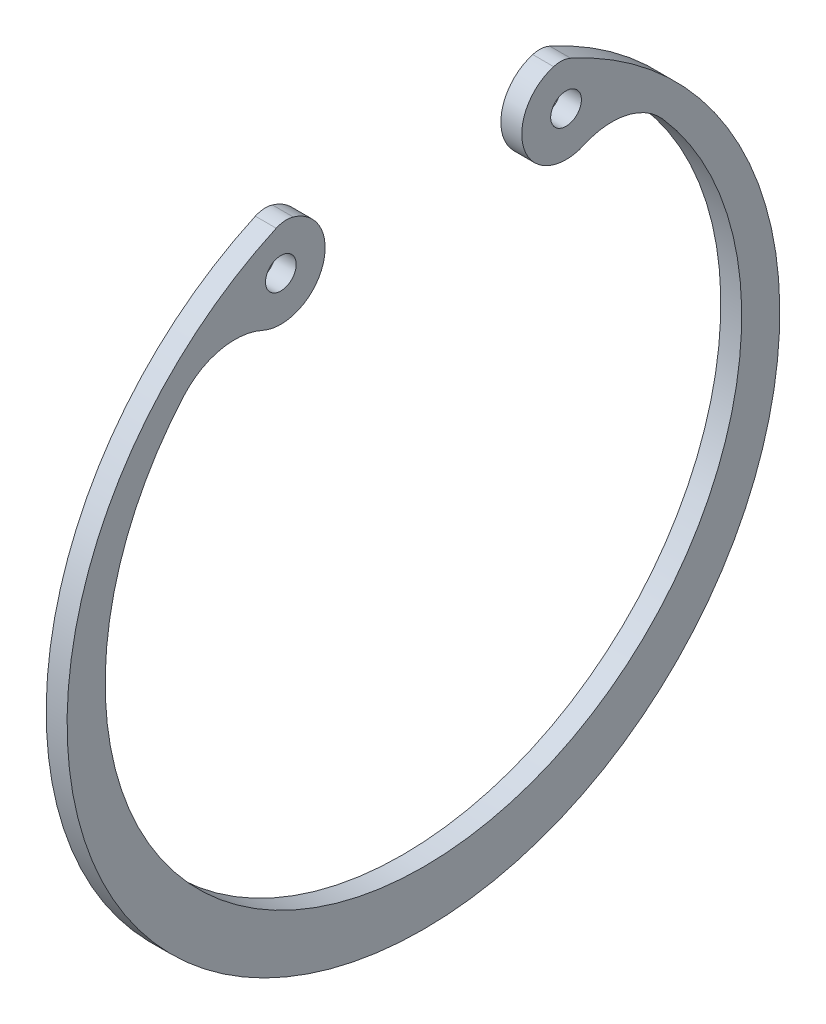
ISO-10303-21;
HEADER;
FILE_DESCRIPTION(('STEP AP214'),'2;1');
FILE_NAME('part.step','',(''),(''),'','','');
FILE_SCHEMA(('AUTOMOTIVE_DESIGN { 1 0 10303 214 1 1 1 1 }'));
ENDSEC;
DATA;
#1=APPLICATION_CONTEXT('core data for automotive mechanical design processes');
#2=APPLICATION_PROTOCOL_DEFINITION('international standard','automotive_design',2000,#1);
#3=PRODUCT_CONTEXT('',#1,'mechanical');
#4=PRODUCT('Part','Part','',(#3));
#5=PRODUCT_RELATED_PRODUCT_CATEGORY('part','',(#4));
#6=PRODUCT_DEFINITION_FORMATION('','',#4);
#7=PRODUCT_DEFINITION_CONTEXT('part definition',#1,'design');
#8=PRODUCT_DEFINITION('design','',#6,#7);
#9=PRODUCT_DEFINITION_SHAPE('','',#8);
#10=(LENGTH_UNIT() NAMED_UNIT(*) SI_UNIT(.MILLI.,.METRE.));
#11=(NAMED_UNIT(*) PLANE_ANGLE_UNIT() SI_UNIT($,.RADIAN.));
#12=(NAMED_UNIT(*) SI_UNIT($,.STERADIAN.) SOLID_ANGLE_UNIT());
#13=UNCERTAINTY_MEASURE_WITH_UNIT(LENGTH_MEASURE(1.E-05),#10,'distance_accuracy_value','');
#14=(GEOMETRIC_REPRESENTATION_CONTEXT(3) GLOBAL_UNCERTAINTY_ASSIGNED_CONTEXT((#13)) GLOBAL_UNIT_ASSIGNED_CONTEXT((#10,
#11,#12)) REPRESENTATION_CONTEXT('',''));
#15=CARTESIAN_POINT('',(0.,0.,0.));
#16=DIRECTION('',(0.,0.,1.));
#17=DIRECTION('',(1.,0.,0.));
#18=AXIS2_PLACEMENT_3D('',#15,#16,#17);
#19=CARTESIAN_POINT('',(1.7,12.2939193308794,5.5775933417407));
#20=DIRECTION('',(1.,0.,0.));
#21=DIRECTION('',(0.,0.,-1.));
#22=AXIS2_PLACEMENT_3D('',#19,#20,#21);
#23=PLANE('',#22);
#24=CARTESIAN_POINT('',(1.7,23.0477601133339,-11.6041988113305));
#25=DIRECTION('',(1.,0.,0.));
#26=DIRECTION('',(0.,0.,-1.));
#27=AXIS2_PLACEMENT_3D('',#24,#25,#26);
#28=CIRCLE('',#27,1.25);
#29=CARTESIAN_POINT('',(1.7,23.0477601133339,-12.8541988113305));
#30=VERTEX_POINT('',#29);
#31=EDGE_CURVE('E146',#30,#30,#28,.T.);
#32=ORIENTED_EDGE('',*,*,#31,.F.);
#33=EDGE_LOOP('',(#32));
#34=FACE_BOUND('',#33,.T.);
#35=CARTESIAN_POINT('',(1.7,24.5878386617588,11.1551866834814));
#36=DIRECTION('',(1.,0.,0.));
#37=DIRECTION('',(0.,0.,-1.));
#38=AXIS2_PLACEMENT_3D('',#35,#36,#37);
#39=CIRCLE('',#38,2.);
#40=CARTESIAN_POINT('',(1.7,26.5078981176658,10.5953905725783));
#41=VERTEX_POINT('',#40);
#42=CARTESIAN_POINT('',(1.7,26.4091600441113,11.9814968081837));
#43=VERTEX_POINT('',#42);
#44=EDGE_CURVE('E157',#41,#43,#39,.T.);
#45=ORIENTED_EDGE('',*,*,#44,.T.);
#46=CARTESIAN_POINT('',(1.7,0.,0.));
#47=DIRECTION('',(1.,0.,0.));
#48=DIRECTION('',(0.,0.,-1.));
#49=AXIS2_PLACEMENT_3D('',#46,#47,#48);
#50=CIRCLE('',#49,29.);
#51=CARTESIAN_POINT('',(1.7,26.4091600441113,-11.9814968081837));
#52=VERTEX_POINT('',#51);
#53=EDGE_CURVE('E105',#43,#52,#50,.T.);
#54=ORIENTED_EDGE('',*,*,#53,.T.);
#55=CARTESIAN_POINT('',(1.7,24.5878386617588,-11.1551866834814));
#56=DIRECTION('',(1.,0.,0.));
#57=DIRECTION('',(0.,0.,1.));
#58=AXIS2_PLACEMENT_3D('',#55,#56,#57);
#59=CIRCLE('',#58,2.);
#60=CARTESIAN_POINT('',(1.7,26.5078981176658,-10.5953905725783));
#61=VERTEX_POINT('',#60);
#62=EDGE_CURVE('E172',#52,#61,#59,.T.);
#63=ORIENTED_EDGE('',*,*,#62,.T.);
#64=CARTESIAN_POINT('',(1.7,23.0477601133339,-11.6041988113305));
#65=DIRECTION('',(1.,0.,0.));
#66=DIRECTION('',(0.,0.,-1.));
#67=AXIS2_PLACEMENT_3D('',#64,#65,#66);
#68=CIRCLE('',#67,3.60419881133045);
#69=CARTESIAN_POINT('',(1.7,19.7612511794198,-13.0837622938814));
#70=VERTEX_POINT('',#69);
#71=EDGE_CURVE('E185',#61,#70,#68,.T.);
#72=ORIENTED_EDGE('',*,*,#71,.T.);
#73=CARTESIAN_POINT('',(1.7,14.7460452813147,-15.3415731361825));
#74=DIRECTION('',(-1.,0.,0.));
#75=DIRECTION('',(0.,0.,-1.));
#76=AXIS2_PLACEMENT_3D('',#73,#74,#75);
#77=CIRCLE('',#76,5.5);
#78=CARTESIAN_POINT('',(1.7,18.3712045483358,-19.4777815797611));
#79=VERTEX_POINT('',#78);
#80=EDGE_CURVE('E124',#70,#79,#77,.T.);
#81=ORIENTED_EDGE('',*,*,#80,.T.);
#82=CARTESIAN_POINT('',(1.7,1.3,0.));
#83=DIRECTION('',(-1.,0.,0.));
#84=DIRECTION('',(0.,0.,-1.));
#85=AXIS2_PLACEMENT_3D('',#82,#83,#84);
#86=CIRCLE('',#85,25.9);
#87=CARTESIAN_POINT('',(1.7,18.3712045483358,19.4777815797611));
#88=VERTEX_POINT('',#87);
#89=EDGE_CURVE('E118',#79,#88,#86,.T.);
#90=ORIENTED_EDGE('',*,*,#89,.T.);
#91=CARTESIAN_POINT('',(1.7,14.7460452813147,15.3415731361825));
#92=DIRECTION('',(-1.,0.,0.));
#93=DIRECTION('',(0.,0.,1.));
#94=AXIS2_PLACEMENT_3D('',#91,#92,#93);
#95=CIRCLE('',#94,5.5);
#96=CARTESIAN_POINT('',(1.7,19.7612511794198,13.0837622938814));
#97=VERTEX_POINT('',#96);
#98=EDGE_CURVE('E122',#88,#97,#95,.T.);
#99=ORIENTED_EDGE('',*,*,#98,.T.);
#100=CARTESIAN_POINT('',(1.7,23.0477601133339,11.6041988113305));
#101=DIRECTION('',(1.,0.,0.));
#102=DIRECTION('',(0.,0.,1.));
#103=AXIS2_PLACEMENT_3D('',#100,#101,#102);
#104=CIRCLE('',#103,3.60419881133045);
#105=EDGE_CURVE('E62',#97,#41,#104,.T.);
#106=ORIENTED_EDGE('',*,*,#105,.T.);
#107=EDGE_LOOP('',(#45,#54,#63,#72,#81,#90,#99,#106));
#108=FACE_BOUND('',#107,.T.);
#109=CARTESIAN_POINT('',(1.7,23.0477601133339,11.6041988113305));
#110=DIRECTION('',(1.,0.,0.));
#111=DIRECTION('',(0.,0.,1.));
#112=AXIS2_PLACEMENT_3D('',#109,#110,#111);
#113=CIRCLE('',#112,1.25);
#114=CARTESIAN_POINT('',(1.7,23.0477601133339,12.8541988113305));
#115=VERTEX_POINT('',#114);
#116=EDGE_CURVE('E194',#115,#115,#113,.T.);
#117=ORIENTED_EDGE('',*,*,#116,.F.);
#118=EDGE_LOOP('',(#117));
#119=FACE_BOUND('',#118,.T.);
#120=ADVANCED_FACE('F45',(#34,#108,#119),#23,.T.);
#121=CARTESIAN_POINT('',(0.,12.2939193308794,5.5775933417407));
#122=DIRECTION('',(1.,0.,0.));
#123=DIRECTION('',(0.,0.,-1.));
#124=AXIS2_PLACEMENT_3D('',#121,#122,#123);
#125=PLANE('',#124);
#126=CARTESIAN_POINT('',(0.,24.5878386617588,11.1551866834814));
#127=DIRECTION('',(1.,0.,0.));
#128=DIRECTION('',(0.,0.,-1.));
#129=AXIS2_PLACEMENT_3D('',#126,#127,#128);
#130=CIRCLE('',#129,2.);
#131=CARTESIAN_POINT('',(0.,26.5078981176658,10.5953905725783));
#132=VERTEX_POINT('',#131);
#133=CARTESIAN_POINT('',(0.,26.4091600441113,11.9814968081837));
#134=VERTEX_POINT('',#133);
#135=EDGE_CURVE('E142',#132,#134,#130,.T.);
#136=ORIENTED_EDGE('',*,*,#135,.F.);
#137=CARTESIAN_POINT('',(0.,23.0477601133339,11.6041988113305));
#138=DIRECTION('',(1.,0.,0.));
#139=DIRECTION('',(0.,0.,1.));
#140=AXIS2_PLACEMENT_3D('',#137,#138,#139);
#141=CIRCLE('',#140,3.60419881133045);
#142=CARTESIAN_POINT('',(0.,19.7612511794198,13.0837622938814));
#143=VERTEX_POINT('',#142);
#144=EDGE_CURVE('E97',#143,#132,#141,.T.);
#145=ORIENTED_EDGE('',*,*,#144,.F.);
#146=CARTESIAN_POINT('',(0.,14.7460452813147,15.3415731361825));
#147=DIRECTION('',(-1.,0.,0.));
#148=DIRECTION('',(0.,0.,1.));
#149=AXIS2_PLACEMENT_3D('',#146,#147,#148);
#150=CIRCLE('',#149,5.5);
#151=CARTESIAN_POINT('',(0.,18.3712045483358,19.4777815797611));
#152=VERTEX_POINT('',#151);
#153=EDGE_CURVE('E91',#152,#143,#150,.T.);
#154=ORIENTED_EDGE('',*,*,#153,.F.);
#155=CARTESIAN_POINT('',(0.,1.3,0.));
#156=DIRECTION('',(-1.,0.,0.));
#157=DIRECTION('',(0.,0.,-1.));
#158=AXIS2_PLACEMENT_3D('',#155,#156,#157);
#159=CIRCLE('',#158,25.9);
#160=CARTESIAN_POINT('',(0.,18.3712045483358,-19.4777815797611));
#161=VERTEX_POINT('',#160);
#162=EDGE_CURVE('E132',#161,#152,#159,.T.);
#163=ORIENTED_EDGE('',*,*,#162,.F.);
#164=CARTESIAN_POINT('',(0.,14.7460452813147,-15.3415731361825));
#165=DIRECTION('',(-1.,0.,0.));
#166=DIRECTION('',(0.,0.,-1.));
#167=AXIS2_PLACEMENT_3D('',#164,#165,#166);
#168=CIRCLE('',#167,5.5);
#169=CARTESIAN_POINT('',(0.,19.7612511794198,-13.0837622938814));
#170=VERTEX_POINT('',#169);
#171=EDGE_CURVE('E152',#170,#161,#168,.T.);
#172=ORIENTED_EDGE('',*,*,#171,.F.);
#173=CARTESIAN_POINT('',(0.,23.0477601133339,-11.6041988113305));
#174=DIRECTION('',(1.,0.,0.));
#175=DIRECTION('',(0.,0.,-1.));
#176=AXIS2_PLACEMENT_3D('',#173,#174,#175);
#177=CIRCLE('',#176,3.60419881133045);
#178=CARTESIAN_POINT('',(0.,26.5078981176658,-10.5953905725783));
#179=VERTEX_POINT('',#178);
#180=EDGE_CURVE('E150',#179,#170,#177,.T.);
#181=ORIENTED_EDGE('',*,*,#180,.F.);
#182=CARTESIAN_POINT('',(0.,24.5878386617588,-11.1551866834814));
#183=DIRECTION('',(1.,0.,0.));
#184=DIRECTION('',(0.,0.,1.));
#185=AXIS2_PLACEMENT_3D('',#182,#183,#184);
#186=CIRCLE('',#185,2.);
#187=CARTESIAN_POINT('',(0.,26.4091600441113,-11.9814968081837));
#188=VERTEX_POINT('',#187);
#189=EDGE_CURVE('E148',#188,#179,#186,.T.);
#190=ORIENTED_EDGE('',*,*,#189,.F.);
#191=CARTESIAN_POINT('',(0.,0.,0.));
#192=DIRECTION('',(1.,0.,0.));
#193=DIRECTION('',(0.,0.,-1.));
#194=AXIS2_PLACEMENT_3D('',#191,#192,#193);
#195=CIRCLE('',#194,29.);
#196=EDGE_CURVE('E145',#134,#188,#195,.T.);
#197=ORIENTED_EDGE('',*,*,#196,.F.);
#198=EDGE_LOOP('',(#136,#145,#154,#163,#172,#181,#190,#197));
#199=FACE_BOUND('',#198,.T.);
#200=CARTESIAN_POINT('',(0.,23.0477601133339,-11.6041988113305));
#201=DIRECTION('',(1.,0.,0.));
#202=DIRECTION('',(0.,0.,-1.));
#203=AXIS2_PLACEMENT_3D('',#200,#201,#202);
#204=CIRCLE('',#203,1.25);
#205=CARTESIAN_POINT('',(0.,23.0477601133339,-12.8541988113305));
#206=VERTEX_POINT('',#205);
#207=EDGE_CURVE('E191',#206,#206,#204,.T.);
#208=ORIENTED_EDGE('',*,*,#207,.T.);
#209=EDGE_LOOP('',(#208));
#210=FACE_BOUND('',#209,.T.);
#211=CARTESIAN_POINT('',(0.,23.0477601133339,11.6041988113305));
#212=DIRECTION('',(1.,0.,0.));
#213=DIRECTION('',(0.,0.,1.));
#214=AXIS2_PLACEMENT_3D('',#211,#212,#213);
#215=CIRCLE('',#214,1.25);
#216=CARTESIAN_POINT('',(0.,23.0477601133339,12.8541988113305));
#217=VERTEX_POINT('',#216);
#218=EDGE_CURVE('E197',#217,#217,#215,.T.);
#219=ORIENTED_EDGE('',*,*,#218,.T.);
#220=EDGE_LOOP('',(#219));
#221=FACE_BOUND('',#220,.T.);
#222=ADVANCED_FACE('F176',(#199,#210,#221),#125,.F.);
#223=CARTESIAN_POINT('',(1.7,24.5878386617588,11.1551866834814));
#224=DIRECTION('',(-1.,0.,0.));
#225=DIRECTION('',(0.,0.,1.));
#226=AXIS2_PLACEMENT_3D('',#223,#224,#225);
#227=CYLINDRICAL_SURFACE('',#226,2.);
#228=ORIENTED_EDGE('',*,*,#135,.T.);
#229=DIRECTION('',(-1.,0.,0.));
#230=VECTOR('',#229,1.);
#231=CARTESIAN_POINT('',(1.7,26.4091600441113,11.9814968081837));
#232=LINE('',#231,#230);
#233=EDGE_CURVE('E13',#43,#134,#232,.T.);
#234=ORIENTED_EDGE('',*,*,#233,.F.);
#235=ORIENTED_EDGE('',*,*,#44,.F.);
#236=DIRECTION('',(-1.,0.,0.));
#237=VECTOR('',#236,1.);
#238=CARTESIAN_POINT('',(1.7,26.5078981176658,10.5953905725783));
#239=LINE('',#238,#237);
#240=EDGE_CURVE('E138',#41,#132,#239,.T.);
#241=ORIENTED_EDGE('',*,*,#240,.T.);
#242=EDGE_LOOP('',(#228,#234,#235,#241));
#243=FACE_BOUND('',#242,.T.);
#244=ADVANCED_FACE('F47',(#243),#227,.T.);
#245=CARTESIAN_POINT('',(1.7,0.,0.));
#246=DIRECTION('',(-1.,0.,0.));
#247=DIRECTION('',(0.,0.,1.));
#248=AXIS2_PLACEMENT_3D('',#245,#246,#247);
#249=CYLINDRICAL_SURFACE('',#248,29.);
#250=ORIENTED_EDGE('',*,*,#196,.T.);
#251=DIRECTION('',(-1.,0.,0.));
#252=VECTOR('',#251,1.);
#253=CARTESIAN_POINT('',(1.7,26.4091600441113,-11.9814968081837));
#254=LINE('',#253,#252);
#255=EDGE_CURVE('E54',#52,#188,#254,.T.);
#256=ORIENTED_EDGE('',*,*,#255,.F.);
#257=ORIENTED_EDGE('',*,*,#53,.F.);
#258=ORIENTED_EDGE('',*,*,#233,.T.);
#259=EDGE_LOOP('',(#250,#256,#257,#258));
#260=FACE_BOUND('',#259,.T.);
#261=ADVANCED_FACE('F229',(#260),#249,.T.);
#262=CARTESIAN_POINT('',(1.7,24.5878386617588,-11.1551866834814));
#263=DIRECTION('',(-1.,0.,0.));
#264=DIRECTION('',(0.,0.,1.));
#265=AXIS2_PLACEMENT_3D('',#262,#263,#264);
#266=CYLINDRICAL_SURFACE('',#265,2.);
#267=ORIENTED_EDGE('',*,*,#189,.T.);
#268=DIRECTION('',(-1.,0.,0.));
#269=VECTOR('',#268,1.);
#270=CARTESIAN_POINT('',(1.7,26.5078981176658,-10.5953905725783));
#271=LINE('',#270,#269);
#272=EDGE_CURVE('E164',#61,#179,#271,.T.);
#273=ORIENTED_EDGE('',*,*,#272,.F.);
#274=ORIENTED_EDGE('',*,*,#62,.F.);
#275=ORIENTED_EDGE('',*,*,#255,.T.);
#276=EDGE_LOOP('',(#267,#273,#274,#275));
#277=FACE_BOUND('',#276,.T.);
#278=ADVANCED_FACE('F170',(#277),#266,.T.);
#279=CARTESIAN_POINT('',(1.7,23.0477601133339,-11.6041988113305));
#280=DIRECTION('',(-1.,0.,0.));
#281=DIRECTION('',(0.,0.,1.));
#282=AXIS2_PLACEMENT_3D('',#279,#280,#281);
#283=CYLINDRICAL_SURFACE('',#282,3.60419881133045);
#284=ORIENTED_EDGE('',*,*,#180,.T.);
#285=DIRECTION('',(-1.,0.,0.));
#286=VECTOR('',#285,1.);
#287=CARTESIAN_POINT('',(1.7,19.7612511794198,-13.0837622938814));
#288=LINE('',#287,#286);
#289=EDGE_CURVE('E161',#70,#170,#288,.T.);
#290=ORIENTED_EDGE('',*,*,#289,.F.);
#291=ORIENTED_EDGE('',*,*,#71,.F.);
#292=ORIENTED_EDGE('',*,*,#272,.T.);
#293=EDGE_LOOP('',(#284,#290,#291,#292));
#294=FACE_BOUND('',#293,.T.);
#295=ADVANCED_FACE('F181',(#294),#283,.T.);
#296=CARTESIAN_POINT('',(1.7,14.7460452813147,-15.3415731361825));
#297=DIRECTION('',(-1.,0.,0.));
#298=DIRECTION('',(0.,0.,1.));
#299=AXIS2_PLACEMENT_3D('',#296,#297,#298);
#300=CYLINDRICAL_SURFACE('',#299,5.5);
#301=ORIENTED_EDGE('',*,*,#171,.T.);
#302=DIRECTION('',(-1.,0.,0.));
#303=VECTOR('',#302,1.);
#304=CARTESIAN_POINT('',(1.7,18.3712045483358,-19.4777815797611));
#305=LINE('',#304,#303);
#306=EDGE_CURVE('E133',#79,#161,#305,.T.);
#307=ORIENTED_EDGE('',*,*,#306,.F.);
#308=ORIENTED_EDGE('',*,*,#80,.F.);
#309=ORIENTED_EDGE('',*,*,#289,.T.);
#310=EDGE_LOOP('',(#301,#307,#308,#309));
#311=FACE_BOUND('',#310,.T.);
#312=ADVANCED_FACE('F184',(#311),#300,.F.);
#313=CARTESIAN_POINT('',(1.7,1.3,0.));
#314=DIRECTION('',(-1.,0.,0.));
#315=DIRECTION('',(0.,0.,1.));
#316=AXIS2_PLACEMENT_3D('',#313,#314,#315);
#317=CYLINDRICAL_SURFACE('',#316,25.9);
#318=ORIENTED_EDGE('',*,*,#162,.T.);
#319=DIRECTION('',(-1.,0.,0.));
#320=VECTOR('',#319,1.);
#321=CARTESIAN_POINT('',(1.7,18.3712045483358,19.4777815797611));
#322=LINE('',#321,#320);
#323=EDGE_CURVE('E129',#88,#152,#322,.T.);
#324=ORIENTED_EDGE('',*,*,#323,.F.);
#325=ORIENTED_EDGE('',*,*,#89,.F.);
#326=ORIENTED_EDGE('',*,*,#306,.T.);
#327=EDGE_LOOP('',(#318,#324,#325,#326));
#328=FACE_BOUND('',#327,.T.);
#329=ADVANCED_FACE('F130',(#328),#317,.F.);
#330=CARTESIAN_POINT('',(1.7,14.7460452813147,15.3415731361825));
#331=DIRECTION('',(-1.,0.,0.));
#332=DIRECTION('',(0.,0.,1.));
#333=AXIS2_PLACEMENT_3D('',#330,#331,#332);
#334=CYLINDRICAL_SURFACE('',#333,5.5);
#335=ORIENTED_EDGE('',*,*,#153,.T.);
#336=DIRECTION('',(-1.,0.,0.));
#337=VECTOR('',#336,1.);
#338=CARTESIAN_POINT('',(1.7,19.7612511794198,13.0837622938814));
#339=LINE('',#338,#337);
#340=EDGE_CURVE('E134',#97,#143,#339,.T.);
#341=ORIENTED_EDGE('',*,*,#340,.F.);
#342=ORIENTED_EDGE('',*,*,#98,.F.);
#343=ORIENTED_EDGE('',*,*,#323,.T.);
#344=EDGE_LOOP('',(#335,#341,#342,#343));
#345=FACE_BOUND('',#344,.T.);
#346=ADVANCED_FACE('F136',(#345),#334,.F.);
#347=CARTESIAN_POINT('',(1.7,23.0477601133339,11.6041988113305));
#348=DIRECTION('',(-1.,0.,0.));
#349=DIRECTION('',(0.,0.,1.));
#350=AXIS2_PLACEMENT_3D('',#347,#348,#349);
#351=CYLINDRICAL_SURFACE('',#350,3.60419881133045);
#352=ORIENTED_EDGE('',*,*,#144,.T.);
#353=ORIENTED_EDGE('',*,*,#240,.F.);
#354=ORIENTED_EDGE('',*,*,#105,.F.);
#355=ORIENTED_EDGE('',*,*,#340,.T.);
#356=EDGE_LOOP('',(#352,#353,#354,#355));
#357=FACE_BOUND('',#356,.T.);
#358=ADVANCED_FACE('F217',(#357),#351,.T.);
#359=CARTESIAN_POINT('',(1.7,23.0477601133339,-11.6041988113305));
#360=DIRECTION('',(-1.,0.,0.));
#361=DIRECTION('',(0.,0.,1.));
#362=AXIS2_PLACEMENT_3D('',#359,#360,#361);
#363=CYLINDRICAL_SURFACE('',#362,1.25);
#364=ORIENTED_EDGE('',*,*,#31,.T.);
#365=EDGE_LOOP('',(#364));
#366=FACE_BOUND('',#365,.T.);
#367=ORIENTED_EDGE('',*,*,#207,.F.);
#368=EDGE_LOOP('',(#367));
#369=FACE_BOUND('',#368,.T.);
#370=ADVANCED_FACE('F214',(#366,#369),#363,.F.);
#371=CARTESIAN_POINT('',(1.7,23.0477601133339,11.6041988113305));
#372=DIRECTION('',(-1.,0.,0.));
#373=DIRECTION('',(0.,0.,1.));
#374=AXIS2_PLACEMENT_3D('',#371,#372,#373);
#375=CYLINDRICAL_SURFACE('',#374,1.25);
#376=ORIENTED_EDGE('',*,*,#116,.T.);
#377=EDGE_LOOP('',(#376));
#378=FACE_BOUND('',#377,.T.);
#379=ORIENTED_EDGE('',*,*,#218,.F.);
#380=EDGE_LOOP('',(#379));
#381=FACE_BOUND('',#380,.T.);
#382=ADVANCED_FACE('F203',(#378,#381),#375,.F.);
#383=CLOSED_SHELL('',(#120,#222,#244,#261,#278,#295,#312,#329,#346,#358,#370,#382));
#384=MANIFOLD_SOLID_BREP('B2',#383);
#385=ADVANCED_BREP_SHAPE_REPRESENTATION('',(#18,#384),#14);
#386=SHAPE_DEFINITION_REPRESENTATION(#9,#385);
ENDSEC;
END-ISO-10303-21;
